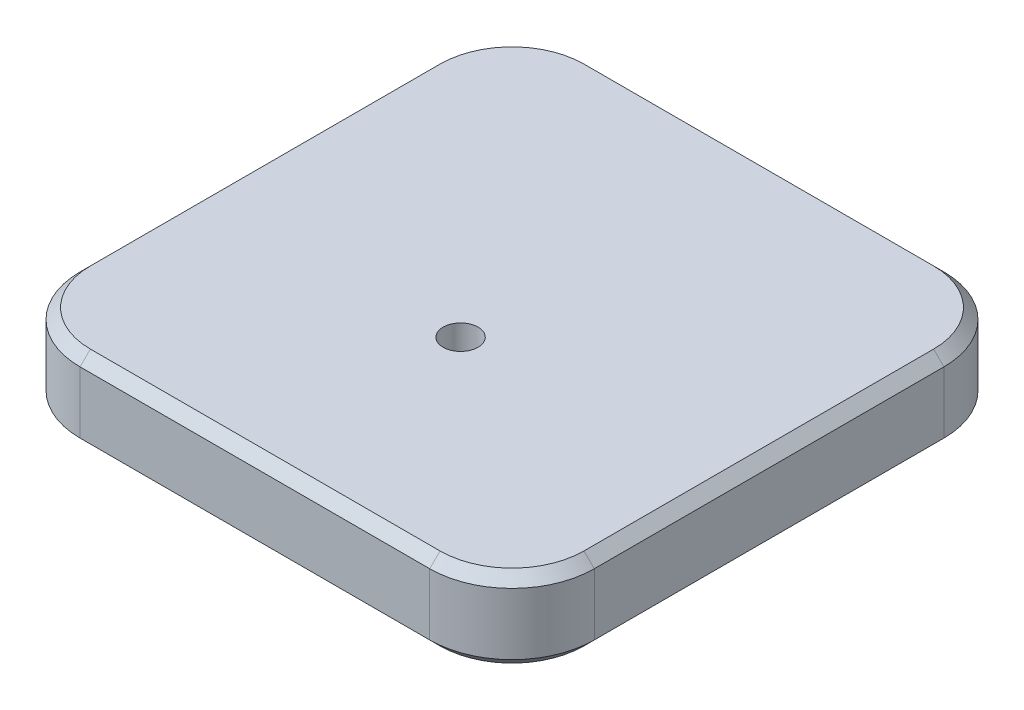
ISO-10303-21;
HEADER;
FILE_DESCRIPTION(('STEP AP214'),'2;1');
FILE_NAME('part.step','',(''),(''),'','','');
FILE_SCHEMA(('AUTOMOTIVE_DESIGN { 1 0 10303 214 1 1 1 1 }'));
ENDSEC;
DATA;
#1=APPLICATION_CONTEXT('core data for automotive mechanical design processes');
#2=APPLICATION_PROTOCOL_DEFINITION('international standard','automotive_design',2000,#1);
#3=PRODUCT_CONTEXT('',#1,'mechanical');
#4=PRODUCT('Part','Part','',(#3));
#5=PRODUCT_RELATED_PRODUCT_CATEGORY('part','',(#4));
#6=PRODUCT_DEFINITION_FORMATION('','',#4);
#7=PRODUCT_DEFINITION_CONTEXT('part definition',#1,'design');
#8=PRODUCT_DEFINITION('design','',#6,#7);
#9=PRODUCT_DEFINITION_SHAPE('','',#8);
#10=(LENGTH_UNIT() NAMED_UNIT(*) SI_UNIT(.MILLI.,.METRE.));
#11=(NAMED_UNIT(*) PLANE_ANGLE_UNIT() SI_UNIT($,.RADIAN.));
#12=(NAMED_UNIT(*) SI_UNIT($,.STERADIAN.) SOLID_ANGLE_UNIT());
#13=UNCERTAINTY_MEASURE_WITH_UNIT(LENGTH_MEASURE(1.E-05),#10,'distance_accuracy_value','');
#14=(GEOMETRIC_REPRESENTATION_CONTEXT(3) GLOBAL_UNCERTAINTY_ASSIGNED_CONTEXT((#13)) GLOBAL_UNIT_ASSIGNED_CONTEXT((#10,
#11,#12)) REPRESENTATION_CONTEXT('',''));
#15=CARTESIAN_POINT('',(0.,0.,0.));
#16=DIRECTION('',(0.,0.,1.));
#17=DIRECTION('',(1.,0.,0.));
#18=AXIS2_PLACEMENT_3D('',#15,#16,#17);
#19=CARTESIAN_POINT('',(-17.6882873331806,4.,-15.9443716806135));
#20=DIRECTION('',(1.,0.,0.));
#21=DIRECTION('',(0.,0.,-1.));
#22=AXIS2_PLACEMENT_3D('',#19,#20,#21);
#23=PLANE('',#22);
#24=DIRECTION('',(0.,-1.,0.));
#25=VECTOR('',#24,1.);
#26=CARTESIAN_POINT('',(-17.6882873331806,4.,-11.9443716806135));
#27=LINE('',#26,#25);
#28=CARTESIAN_POINT('',(-17.6882873331806,3.5,-11.9443716806135));
#29=VERTEX_POINT('',#28);
#30=CARTESIAN_POINT('',(-17.6882873331806,0.499999999999997,-11.9443716806135));
#31=VERTEX_POINT('',#30);
#32=EDGE_CURVE('E284',#29,#31,#27,.T.);
#33=ORIENTED_EDGE('',*,*,#32,.T.);
#34=DIRECTION('',(0.,0.,1.));
#35=VECTOR('',#34,1.);
#36=CARTESIAN_POINT('',(-17.6882873331806,0.499999999999997,-15.9443716806135));
#37=LINE('',#36,#35);
#38=CARTESIAN_POINT('',(-17.6882873331806,0.499999999999997,5.05562831938651));
#39=VERTEX_POINT('',#38);
#40=EDGE_CURVE('E196',#31,#39,#37,.T.);
#41=ORIENTED_EDGE('',*,*,#40,.T.);
#42=DIRECTION('',(0.,-1.,0.));
#43=VECTOR('',#42,1.);
#44=CARTESIAN_POINT('',(-17.6882873331806,4.,5.05562831938651));
#45=LINE('',#44,#43);
#46=CARTESIAN_POINT('',(-17.6882873331806,3.5,5.05562831938651));
#47=VERTEX_POINT('',#46);
#48=EDGE_CURVE('E368',#39,#47,#45,.F.);
#49=ORIENTED_EDGE('',*,*,#48,.T.);
#50=DIRECTION('',(0.,0.,-1.));
#51=VECTOR('',#50,1.);
#52=CARTESIAN_POINT('',(-17.6882873331806,3.5,-11.9443716806135));
#53=LINE('',#52,#51);
#54=EDGE_CURVE('E194',#47,#29,#53,.T.);
#55=ORIENTED_EDGE('',*,*,#54,.T.);
#56=EDGE_LOOP('',(#33,#41,#49,#55));
#57=FACE_BOUND('',#56,.T.);
#58=ADVANCED_FACE('F38',(#57),#23,.F.);
#59=CARTESIAN_POINT('',(-17.6882873331806,4.,9.05562831938651));
#60=DIRECTION('',(0.,0.,-1.));
#61=DIRECTION('',(-1.,0.,0.));
#62=AXIS2_PLACEMENT_3D('',#59,#60,#61);
#63=PLANE('',#62);
#64=DIRECTION('',(0.,-1.,0.));
#65=VECTOR('',#64,1.);
#66=CARTESIAN_POINT('',(-13.6882873331806,4.,9.05562831938651));
#67=LINE('',#66,#65);
#68=CARTESIAN_POINT('',(-13.6882873331806,3.5,9.05562831938651));
#69=VERTEX_POINT('',#68);
#70=CARTESIAN_POINT('',(-13.6882873331806,0.499999999999997,9.05562831938651));
#71=VERTEX_POINT('',#70);
#72=EDGE_CURVE('E301',#69,#71,#67,.T.);
#73=ORIENTED_EDGE('',*,*,#72,.T.);
#74=DIRECTION('',(1.,0.,0.));
#75=VECTOR('',#74,1.);
#76=CARTESIAN_POINT('',(-17.6882873331806,0.499999999999997,9.05562831938651));
#77=LINE('',#76,#75);
#78=CARTESIAN_POINT('',(3.31171266681941,0.499999999999997,9.05562831938651));
#79=VERTEX_POINT('',#78);
#80=EDGE_CURVE('E204',#71,#79,#77,.T.);
#81=ORIENTED_EDGE('',*,*,#80,.T.);
#82=DIRECTION('',(0.,-1.,0.));
#83=VECTOR('',#82,1.);
#84=CARTESIAN_POINT('',(3.31171266681941,4.,9.05562831938651));
#85=LINE('',#84,#83);
#86=CARTESIAN_POINT('',(3.31171266681941,3.5,9.05562831938651));
#87=VERTEX_POINT('',#86);
#88=EDGE_CURVE('E171',#79,#87,#85,.F.);
#89=ORIENTED_EDGE('',*,*,#88,.T.);
#90=DIRECTION('',(-1.,0.,0.));
#91=VECTOR('',#90,1.);
#92=CARTESIAN_POINT('',(-13.6882873331806,3.5,9.05562831938651));
#93=LINE('',#92,#91);
#94=EDGE_CURVE('E202',#87,#69,#93,.T.);
#95=ORIENTED_EDGE('',*,*,#94,.T.);
#96=EDGE_LOOP('',(#73,#81,#89,#95));
#97=FACE_BOUND('',#96,.T.);
#98=ADVANCED_FACE('F347',(#97),#63,.F.);
#99=CARTESIAN_POINT('',(7.3117126668194,4.,-15.9443716806135));
#100=DIRECTION('',(-1.,0.,0.));
#101=DIRECTION('',(0.,0.,1.));
#102=AXIS2_PLACEMENT_3D('',#99,#100,#101);
#103=PLANE('',#102);
#104=DIRECTION('',(0.,-1.,0.));
#105=VECTOR('',#104,1.);
#106=CARTESIAN_POINT('',(7.31171266681941,4.,5.0556283193865));
#107=LINE('',#106,#105);
#108=CARTESIAN_POINT('',(7.31171266681941,3.5,5.0556283193865));
#109=VERTEX_POINT('',#108);
#110=CARTESIAN_POINT('',(7.31171266681941,0.499999999999997,5.0556283193865));
#111=VERTEX_POINT('',#110);
#112=EDGE_CURVE('E290',#109,#111,#107,.T.);
#113=ORIENTED_EDGE('',*,*,#112,.T.);
#114=DIRECTION('',(0.,0.,-1.));
#115=VECTOR('',#114,1.);
#116=CARTESIAN_POINT('',(7.3117126668194,0.499999999999997,-15.9443716806135));
#117=LINE('',#116,#115);
#118=CARTESIAN_POINT('',(7.31171266681941,0.499999999999997,-11.9443716806135));
#119=VERTEX_POINT('',#118);
#120=EDGE_CURVE('E213',#111,#119,#117,.T.);
#121=ORIENTED_EDGE('',*,*,#120,.T.);
#122=DIRECTION('',(0.,-1.,0.));
#123=VECTOR('',#122,1.);
#124=CARTESIAN_POINT('',(7.31171266681941,4.,-11.9443716806135));
#125=LINE('',#124,#123);
#126=CARTESIAN_POINT('',(7.31171266681941,3.5,-11.9443716806135));
#127=VERTEX_POINT('',#126);
#128=EDGE_CURVE('E294',#119,#127,#125,.F.);
#129=ORIENTED_EDGE('',*,*,#128,.T.);
#130=DIRECTION('',(0.,0.,1.));
#131=VECTOR('',#130,1.);
#132=CARTESIAN_POINT('',(7.31171266681941,3.5,5.0556283193865));
#133=LINE('',#132,#131);
#134=EDGE_CURVE('E211',#127,#109,#133,.T.);
#135=ORIENTED_EDGE('',*,*,#134,.T.);
#136=EDGE_LOOP('',(#113,#121,#129,#135));
#137=FACE_BOUND('',#136,.T.);
#138=ADVANCED_FACE('F327',(#137),#103,.F.);
#139=CARTESIAN_POINT('',(-17.6882873331806,4.,-15.9443716806135));
#140=DIRECTION('',(0.,0.,1.));
#141=DIRECTION('',(1.,0.,0.));
#142=AXIS2_PLACEMENT_3D('',#139,#140,#141);
#143=PLANE('',#142);
#144=DIRECTION('',(0.,-1.,0.));
#145=VECTOR('',#144,1.);
#146=CARTESIAN_POINT('',(3.3117126668194,4.,-15.9443716806135));
#147=LINE('',#146,#145);
#148=CARTESIAN_POINT('',(3.3117126668194,3.5,-15.9443716806135));
#149=VERTEX_POINT('',#148);
#150=CARTESIAN_POINT('',(3.3117126668194,0.499999999999997,-15.9443716806135));
#151=VERTEX_POINT('',#150);
#152=EDGE_CURVE('E291',#149,#151,#147,.T.);
#153=ORIENTED_EDGE('',*,*,#152,.T.);
#154=DIRECTION('',(-1.,0.,0.));
#155=VECTOR('',#154,1.);
#156=CARTESIAN_POINT('',(-17.6882873331806,0.499999999999997,-15.9443716806135));
#157=LINE('',#156,#155);
#158=CARTESIAN_POINT('',(-13.6882873331806,0.499999999999997,-15.9443716806135));
#159=VERTEX_POINT('',#158);
#160=EDGE_CURVE('E188',#151,#159,#157,.T.);
#161=ORIENTED_EDGE('',*,*,#160,.T.);
#162=DIRECTION('',(0.,-1.,0.));
#163=VECTOR('',#162,1.);
#164=CARTESIAN_POINT('',(-13.6882873331806,4.,-15.9443716806135));
#165=LINE('',#164,#163);
#166=CARTESIAN_POINT('',(-13.6882873331806,3.5,-15.9443716806135));
#167=VERTEX_POINT('',#166);
#168=EDGE_CURVE('E281',#159,#167,#165,.F.);
#169=ORIENTED_EDGE('',*,*,#168,.T.);
#170=DIRECTION('',(1.,0.,0.));
#171=VECTOR('',#170,1.);
#172=CARTESIAN_POINT('',(3.3117126668194,3.5,-15.9443716806135));
#173=LINE('',#172,#171);
#174=EDGE_CURVE('E186',#167,#149,#173,.T.);
#175=ORIENTED_EDGE('',*,*,#174,.T.);
#176=EDGE_LOOP('',(#153,#161,#169,#175));
#177=FACE_BOUND('',#176,.T.);
#178=ADVANCED_FACE('F287',(#177),#143,.F.);
#179=CARTESIAN_POINT('',(0.,4.,0.));
#180=DIRECTION('',(0.,1.,0.));
#181=DIRECTION('',(0.,0.,1.));
#182=AXIS2_PLACEMENT_3D('',#179,#180,#181);
#183=PLANE('',#182);
#184=DIRECTION('',(1.,0.,0.));
#185=VECTOR('',#184,1.);
#186=CARTESIAN_POINT('',(3.31171266681941,4.,8.55562831938651));
#187=LINE('',#186,#185);
#188=CARTESIAN_POINT('',(-13.6882873331806,4.,8.55562831938651));
#189=VERTEX_POINT('',#188);
#190=CARTESIAN_POINT('',(3.31171266681941,4.,8.55562831938651));
#191=VERTEX_POINT('',#190);
#192=EDGE_CURVE('E47',#189,#191,#187,.T.);
#193=ORIENTED_EDGE('',*,*,#192,.T.);
#194=CARTESIAN_POINT('',(3.31171266681941,4.,5.05562831938651));
#195=DIRECTION('',(0.,1.,0.));
#196=DIRECTION('',(0.,0.,1.));
#197=AXIS2_PLACEMENT_3D('',#194,#195,#196);
#198=CIRCLE('',#197,3.5);
#199=CARTESIAN_POINT('',(6.81171266681941,4.,5.0556283193865));
#200=VERTEX_POINT('',#199);
#201=EDGE_CURVE('E11',#191,#200,#198,.T.);
#202=ORIENTED_EDGE('',*,*,#201,.T.);
#203=DIRECTION('',(0.,0.,-1.));
#204=VECTOR('',#203,1.);
#205=CARTESIAN_POINT('',(6.8117126668194,4.,-11.9443716806135));
#206=LINE('',#205,#204);
#207=CARTESIAN_POINT('',(6.8117126668194,4.,-11.9443716806135));
#208=VERTEX_POINT('',#207);
#209=EDGE_CURVE('E215',#200,#208,#206,.T.);
#210=ORIENTED_EDGE('',*,*,#209,.T.);
#211=CARTESIAN_POINT('',(3.3117126668194,4.,-11.9443716806135));
#212=DIRECTION('',(0.,1.,0.));
#213=DIRECTION('',(0.,0.,1.));
#214=AXIS2_PLACEMENT_3D('',#211,#212,#213);
#215=CIRCLE('',#214,3.5);
#216=CARTESIAN_POINT('',(3.3117126668194,4.,-15.4443716806135));
#217=VERTEX_POINT('',#216);
#218=EDGE_CURVE('E217',#208,#217,#215,.T.);
#219=ORIENTED_EDGE('',*,*,#218,.T.);
#220=DIRECTION('',(-1.,0.,0.));
#221=VECTOR('',#220,1.);
#222=CARTESIAN_POINT('',(-13.6882873331806,4.,-15.4443716806135));
#223=LINE('',#222,#221);
#224=CARTESIAN_POINT('',(-13.6882873331806,4.,-15.4443716806135));
#225=VERTEX_POINT('',#224);
#226=EDGE_CURVE('E219',#217,#225,#223,.T.);
#227=ORIENTED_EDGE('',*,*,#226,.T.);
#228=CARTESIAN_POINT('',(-13.6882873331806,4.,-11.9443716806135));
#229=DIRECTION('',(0.,1.,0.));
#230=DIRECTION('',(0.,0.,1.));
#231=AXIS2_PLACEMENT_3D('',#228,#229,#230);
#232=CIRCLE('',#231,3.5);
#233=CARTESIAN_POINT('',(-17.1882873331806,4.,-11.9443716806135));
#234=VERTEX_POINT('',#233);
#235=EDGE_CURVE('E221',#225,#234,#232,.T.);
#236=ORIENTED_EDGE('',*,*,#235,.T.);
#237=DIRECTION('',(0.,0.,1.));
#238=VECTOR('',#237,1.);
#239=CARTESIAN_POINT('',(-17.1882873331806,4.,5.05562831938651));
#240=LINE('',#239,#238);
#241=CARTESIAN_POINT('',(-17.1882873331806,4.,5.05562831938651));
#242=VERTEX_POINT('',#241);
#243=EDGE_CURVE('E223',#234,#242,#240,.T.);
#244=ORIENTED_EDGE('',*,*,#243,.T.);
#245=CARTESIAN_POINT('',(-13.6882873331806,4.,5.05562831938651));
#246=DIRECTION('',(0.,1.,0.));
#247=DIRECTION('',(0.,0.,1.));
#248=AXIS2_PLACEMENT_3D('',#245,#246,#247);
#249=CIRCLE('',#248,3.5);
#250=EDGE_CURVE('E58',#242,#189,#249,.T.);
#251=ORIENTED_EDGE('',*,*,#250,.T.);
#252=EDGE_LOOP('',(#193,#202,#210,#219,#227,#236,#244,#251));
#253=FACE_BOUND('',#252,.T.);
#254=CARTESIAN_POINT('',(-5.18828733318059,4.,-0.944371680613496));
#255=DIRECTION('',(0.,1.,0.));
#256=DIRECTION('',(0.,0.,1.));
#257=AXIS2_PLACEMENT_3D('',#254,#255,#256);
#258=CIRCLE('',#257,0.849999999999999);
#259=CARTESIAN_POINT('',(-5.18828733318059,4.,-0.0943716806134968));
#260=VERTEX_POINT('',#259);
#261=EDGE_CURVE('E244',#260,#260,#258,.T.);
#262=ORIENTED_EDGE('',*,*,#261,.F.);
#263=EDGE_LOOP('',(#262));
#264=FACE_BOUND('',#263,.T.);
#265=ADVANCED_FACE('F383',(#253,#264),#183,.T.);
#266=CARTESIAN_POINT('',(0.,0.,0.));
#267=DIRECTION('',(0.,1.,0.));
#268=DIRECTION('',(0.,0.,1.));
#269=AXIS2_PLACEMENT_3D('',#266,#267,#268);
#270=PLANE('',#269);
#271=DIRECTION('',(1.,0.,0.));
#272=VECTOR('',#271,1.);
#273=CARTESIAN_POINT('',(0.,0.,-15.4443716806135));
#274=LINE('',#273,#272);
#275=CARTESIAN_POINT('',(-13.6882873331806,0.,-15.4443716806135));
#276=VERTEX_POINT('',#275);
#277=CARTESIAN_POINT('',(3.3117126668194,0.,-15.4443716806135));
#278=VERTEX_POINT('',#277);
#279=EDGE_CURVE('E176',#276,#278,#274,.T.);
#280=ORIENTED_EDGE('',*,*,#279,.T.);
#281=CARTESIAN_POINT('',(3.3117126668194,0.,-11.9443716806135));
#282=DIRECTION('',(0.,1.,0.));
#283=DIRECTION('',(0.,0.,1.));
#284=AXIS2_PLACEMENT_3D('',#281,#282,#283);
#285=CIRCLE('',#284,3.5);
#286=CARTESIAN_POINT('',(6.8117126668194,0.,-11.9443716806135));
#287=VERTEX_POINT('',#286);
#288=EDGE_CURVE('E156',#278,#287,#285,.F.);
#289=ORIENTED_EDGE('',*,*,#288,.T.);
#290=DIRECTION('',(0.,0.,1.));
#291=VECTOR('',#290,1.);
#292=CARTESIAN_POINT('',(6.81171266681941,0.,0.));
#293=LINE('',#292,#291);
#294=CARTESIAN_POINT('',(6.81171266681941,0.,5.0556283193865));
#295=VERTEX_POINT('',#294);
#296=EDGE_CURVE('E164',#287,#295,#293,.T.);
#297=ORIENTED_EDGE('',*,*,#296,.T.);
#298=CARTESIAN_POINT('',(3.31171266681941,0.,5.05562831938651));
#299=DIRECTION('',(0.,1.,0.));
#300=DIRECTION('',(0.,0.,1.));
#301=AXIS2_PLACEMENT_3D('',#298,#299,#300);
#302=CIRCLE('',#301,3.5);
#303=CARTESIAN_POINT('',(3.31171266681941,0.,8.55562831938651));
#304=VERTEX_POINT('',#303);
#305=EDGE_CURVE('E170',#295,#304,#302,.F.);
#306=ORIENTED_EDGE('',*,*,#305,.T.);
#307=DIRECTION('',(-1.,0.,0.));
#308=VECTOR('',#307,1.);
#309=CARTESIAN_POINT('',(0.,0.,8.55562831938651));
#310=LINE('',#309,#308);
#311=CARTESIAN_POINT('',(-13.6882873331806,0.,8.55562831938651));
#312=VERTEX_POINT('',#311);
#313=EDGE_CURVE('E307',#304,#312,#310,.T.);
#314=ORIENTED_EDGE('',*,*,#313,.T.);
#315=CARTESIAN_POINT('',(-13.6882873331806,0.,5.05562831938651));
#316=DIRECTION('',(0.,1.,0.));
#317=DIRECTION('',(0.,0.,1.));
#318=AXIS2_PLACEMENT_3D('',#315,#316,#317);
#319=CIRCLE('',#318,3.5);
#320=CARTESIAN_POINT('',(-17.1882873331806,0.,5.05562831938651));
#321=VERTEX_POINT('',#320);
#322=EDGE_CURVE('E309',#312,#321,#319,.F.);
#323=ORIENTED_EDGE('',*,*,#322,.T.);
#324=DIRECTION('',(0.,0.,-1.));
#325=VECTOR('',#324,1.);
#326=CARTESIAN_POINT('',(-17.1882873331806,0.,0.));
#327=LINE('',#326,#325);
#328=CARTESIAN_POINT('',(-17.1882873331806,0.,-11.9443716806135));
#329=VERTEX_POINT('',#328);
#330=EDGE_CURVE('E311',#321,#329,#327,.T.);
#331=ORIENTED_EDGE('',*,*,#330,.T.);
#332=CARTESIAN_POINT('',(-13.6882873331806,0.,-11.9443716806135));
#333=DIRECTION('',(0.,1.,0.));
#334=DIRECTION('',(0.,0.,1.));
#335=AXIS2_PLACEMENT_3D('',#332,#333,#334);
#336=CIRCLE('',#335,3.5);
#337=EDGE_CURVE('E181',#329,#276,#336,.F.);
#338=ORIENTED_EDGE('',*,*,#337,.T.);
#339=EDGE_LOOP('',(#280,#289,#297,#306,#314,#323,#331,#338));
#340=FACE_BOUND('',#339,.T.);
#341=CARTESIAN_POINT('',(-5.18828733318059,0.,-0.944371680613496));
#342=DIRECTION('',(0.,1.,0.));
#343=DIRECTION('',(0.,0.,1.));
#344=AXIS2_PLACEMENT_3D('',#341,#342,#343);
#345=CIRCLE('',#344,0.849999999999998);
#346=CARTESIAN_POINT('',(-5.18828733318059,0.,-0.0943716806134976));
#347=VERTEX_POINT('',#346);
#348=EDGE_CURVE('E372',#347,#347,#345,.T.);
#349=ORIENTED_EDGE('',*,*,#348,.T.);
#350=EDGE_LOOP('',(#349));
#351=FACE_BOUND('',#350,.T.);
#352=ADVANCED_FACE('F173',(#340,#351),#270,.F.);
#353=CARTESIAN_POINT('',(-13.6882873331806,4.,-11.9443716806135));
#354=DIRECTION('',(0.,-1.,0.));
#355=DIRECTION('',(0.,0.,-1.));
#356=AXIS2_PLACEMENT_3D('',#353,#354,#355);
#357=CYLINDRICAL_SURFACE('',#356,4.);
#358=ORIENTED_EDGE('',*,*,#168,.F.);
#359=CARTESIAN_POINT('',(-13.6882873331806,0.499999999999997,-11.9443716806135));
#360=DIRECTION('',(0.,1.,0.));
#361=DIRECTION('',(0.,0.,1.));
#362=AXIS2_PLACEMENT_3D('',#359,#360,#361);
#363=CIRCLE('',#362,4.);
#364=EDGE_CURVE('E192',#159,#31,#363,.T.);
#365=ORIENTED_EDGE('',*,*,#364,.T.);
#366=ORIENTED_EDGE('',*,*,#32,.F.);
#367=CARTESIAN_POINT('',(-13.6882873331806,3.5,-11.9443716806135));
#368=DIRECTION('',(0.,1.,0.));
#369=DIRECTION('',(0.,0.,1.));
#370=AXIS2_PLACEMENT_3D('',#367,#368,#369);
#371=CIRCLE('',#370,4.);
#372=EDGE_CURVE('E190',#29,#167,#371,.F.);
#373=ORIENTED_EDGE('',*,*,#372,.T.);
#374=EDGE_LOOP('',(#358,#365,#366,#373));
#375=FACE_BOUND('',#374,.T.);
#376=ADVANCED_FACE('F280',(#375),#357,.T.);
#377=CARTESIAN_POINT('',(3.3117126668194,4.,-11.9443716806135));
#378=DIRECTION('',(0.,-1.,0.));
#379=DIRECTION('',(0.,0.,-1.));
#380=AXIS2_PLACEMENT_3D('',#377,#378,#379);
#381=CYLINDRICAL_SURFACE('',#380,4.);
#382=ORIENTED_EDGE('',*,*,#128,.F.);
#383=CARTESIAN_POINT('',(3.3117126668194,0.499999999999997,-11.9443716806135));
#384=DIRECTION('',(0.,1.,0.));
#385=DIRECTION('',(0.,0.,1.));
#386=AXIS2_PLACEMENT_3D('',#383,#384,#385);
#387=CIRCLE('',#386,4.);
#388=EDGE_CURVE('E158',#119,#151,#387,.T.);
#389=ORIENTED_EDGE('',*,*,#388,.T.);
#390=ORIENTED_EDGE('',*,*,#152,.F.);
#391=CARTESIAN_POINT('',(3.3117126668194,3.5,-11.9443716806135));
#392=DIRECTION('',(0.,1.,0.));
#393=DIRECTION('',(0.,0.,1.));
#394=AXIS2_PLACEMENT_3D('',#391,#392,#393);
#395=CIRCLE('',#394,4.);
#396=EDGE_CURVE('E178',#149,#127,#395,.F.);
#397=ORIENTED_EDGE('',*,*,#396,.T.);
#398=EDGE_LOOP('',(#382,#389,#390,#397));
#399=FACE_BOUND('',#398,.T.);
#400=ADVANCED_FACE('F322',(#399),#381,.T.);
#401=CARTESIAN_POINT('',(3.31171266681941,4.,5.05562831938651));
#402=DIRECTION('',(0.,-1.,0.));
#403=DIRECTION('',(0.,0.,-1.));
#404=AXIS2_PLACEMENT_3D('',#401,#402,#403);
#405=CYLINDRICAL_SURFACE('',#404,4.);
#406=ORIENTED_EDGE('',*,*,#88,.F.);
#407=CARTESIAN_POINT('',(3.31171266681941,0.499999999999997,5.05562831938651));
#408=DIRECTION('',(0.,1.,0.));
#409=DIRECTION('',(0.,0.,1.));
#410=AXIS2_PLACEMENT_3D('',#407,#408,#409);
#411=CIRCLE('',#410,4.);
#412=EDGE_CURVE('E209',#79,#111,#411,.T.);
#413=ORIENTED_EDGE('',*,*,#412,.T.);
#414=ORIENTED_EDGE('',*,*,#112,.F.);
#415=CARTESIAN_POINT('',(3.31171266681941,3.5,5.05562831938651));
#416=DIRECTION('',(0.,1.,0.));
#417=DIRECTION('',(0.,0.,1.));
#418=AXIS2_PLACEMENT_3D('',#415,#416,#417);
#419=CIRCLE('',#418,4.);
#420=EDGE_CURVE('E206',#109,#87,#419,.F.);
#421=ORIENTED_EDGE('',*,*,#420,.T.);
#422=EDGE_LOOP('',(#406,#413,#414,#421));
#423=FACE_BOUND('',#422,.T.);
#424=ADVANCED_FACE('F344',(#423),#405,.T.);
#425=CARTESIAN_POINT('',(-13.6882873331806,4.,5.05562831938651));
#426=DIRECTION('',(0.,-1.,0.));
#427=DIRECTION('',(0.,0.,-1.));
#428=AXIS2_PLACEMENT_3D('',#425,#426,#427);
#429=CYLINDRICAL_SURFACE('',#428,4.);
#430=ORIENTED_EDGE('',*,*,#48,.F.);
#431=CARTESIAN_POINT('',(-13.6882873331806,0.499999999999997,5.05562831938651));
#432=DIRECTION('',(0.,1.,0.));
#433=DIRECTION('',(0.,0.,1.));
#434=AXIS2_PLACEMENT_3D('',#431,#432,#433);
#435=CIRCLE('',#434,4.);
#436=EDGE_CURVE('E200',#39,#71,#435,.T.);
#437=ORIENTED_EDGE('',*,*,#436,.T.);
#438=ORIENTED_EDGE('',*,*,#72,.F.);
#439=CARTESIAN_POINT('',(-13.6882873331806,3.5,5.05562831938651));
#440=DIRECTION('',(0.,1.,0.));
#441=DIRECTION('',(0.,0.,1.));
#442=AXIS2_PLACEMENT_3D('',#439,#440,#441);
#443=CIRCLE('',#442,4.);
#444=EDGE_CURVE('E198',#69,#47,#443,.F.);
#445=ORIENTED_EDGE('',*,*,#444,.T.);
#446=EDGE_LOOP('',(#430,#437,#438,#445));
#447=FACE_BOUND('',#446,.T.);
#448=ADVANCED_FACE('F370',(#447),#429,.T.);
#449=CARTESIAN_POINT('',(-5.18828733318059,4.,-0.944371680613496));
#450=DIRECTION('',(0.,1.,0.));
#451=DIRECTION('',(0.,0.,1.));
#452=AXIS2_PLACEMENT_3D('',#449,#450,#451);
#453=CYLINDRICAL_SURFACE('',#452,0.849999999999998);
#454=ORIENTED_EDGE('',*,*,#261,.T.);
#455=EDGE_LOOP('',(#454));
#456=FACE_BOUND('',#455,.T.);
#457=ORIENTED_EDGE('',*,*,#348,.F.);
#458=EDGE_LOOP('',(#457));
#459=FACE_BOUND('',#458,.T.);
#460=ADVANCED_FACE('F380',(#456,#459),#453,.F.);
#461=CARTESIAN_POINT('',(-13.6882873331806,0.,5.05562831938651));
#462=DIRECTION('',(0.,1.,0.));
#463=DIRECTION('',(0.,0.,1.));
#464=AXIS2_PLACEMENT_3D('',#461,#462,#463);
#465=CONICAL_SURFACE('',#464,3.5,0.785398163397452);
#466=DIRECTION('',(0.,-0.707106781186545,-0.70710678118655));
#467=VECTOR('',#466,1.);
#468=CARTESIAN_POINT('',(-13.6882873331806,0.499999999999997,9.05562831938651));
#469=LINE('',#468,#467);
#470=EDGE_CURVE('E238',#71,#312,#469,.T.);
#471=ORIENTED_EDGE('',*,*,#470,.F.);
#472=ORIENTED_EDGE('',*,*,#436,.F.);
#473=DIRECTION('',(-0.70710678118655,0.707106781186545,0.));
#474=VECTOR('',#473,1.);
#475=CARTESIAN_POINT('',(-17.1882873331806,0.,5.05562831938651));
#476=LINE('',#475,#474);
#477=EDGE_CURVE('E241',#321,#39,#476,.T.);
#478=ORIENTED_EDGE('',*,*,#477,.F.);
#479=ORIENTED_EDGE('',*,*,#322,.F.);
#480=EDGE_LOOP('',(#471,#472,#478,#479));
#481=FACE_BOUND('',#480,.T.);
#482=ADVANCED_FACE('F360',(#481),#465,.T.);
#483=CARTESIAN_POINT('',(-17.6882873331806,0.499999999999997,-15.9443716806135));
#484=DIRECTION('',(0.707106781186546,0.707106781186549,0.));
#485=DIRECTION('',(0.,0.,1.));
#486=AXIS2_PLACEMENT_3D('',#483,#484,#485);
#487=PLANE('',#486);
#488=ORIENTED_EDGE('',*,*,#477,.T.);
#489=ORIENTED_EDGE('',*,*,#40,.F.);
#490=DIRECTION('',(-0.70710678118655,0.707106781186545,0.));
#491=VECTOR('',#490,1.);
#492=CARTESIAN_POINT('',(-17.1882873331806,0.,-11.9443716806135));
#493=LINE('',#492,#491);
#494=EDGE_CURVE('E235',#329,#31,#493,.T.);
#495=ORIENTED_EDGE('',*,*,#494,.F.);
#496=ORIENTED_EDGE('',*,*,#330,.F.);
#497=EDGE_LOOP('',(#488,#489,#495,#496));
#498=FACE_BOUND('',#497,.T.);
#499=ADVANCED_FACE('F364',(#498),#487,.F.);
#500=CARTESIAN_POINT('',(-17.6882873331806,0.499999999999997,9.05562831938651));
#501=DIRECTION('',(0.,0.70710678118655,-0.707106781186545));
#502=DIRECTION('',(1.,0.,0.));
#503=AXIS2_PLACEMENT_3D('',#500,#501,#502);
#504=PLANE('',#503);
#505=ORIENTED_EDGE('',*,*,#470,.T.);
#506=ORIENTED_EDGE('',*,*,#313,.F.);
#507=DIRECTION('',(0.,-0.707106781186545,-0.70710678118655));
#508=VECTOR('',#507,1.);
#509=CARTESIAN_POINT('',(3.31171266681941,0.499999999999997,9.05562831938651));
#510=LINE('',#509,#508);
#511=EDGE_CURVE('E232',#79,#304,#510,.T.);
#512=ORIENTED_EDGE('',*,*,#511,.F.);
#513=ORIENTED_EDGE('',*,*,#80,.F.);
#514=EDGE_LOOP('',(#505,#506,#512,#513));
#515=FACE_BOUND('',#514,.T.);
#516=ADVANCED_FACE('F352',(#515),#504,.F.);
#517=CARTESIAN_POINT('',(-13.6882873331806,0.,-11.9443716806135));
#518=DIRECTION('',(0.,1.,0.));
#519=DIRECTION('',(0.,0.,1.));
#520=AXIS2_PLACEMENT_3D('',#517,#518,#519);
#521=CONICAL_SURFACE('',#520,3.5,0.785398163397452);
#522=ORIENTED_EDGE('',*,*,#494,.T.);
#523=ORIENTED_EDGE('',*,*,#364,.F.);
#524=DIRECTION('',(0.,0.707106781186545,-0.70710678118655));
#525=VECTOR('',#524,1.);
#526=CARTESIAN_POINT('',(-13.6882873331806,0.,-15.4443716806135));
#527=LINE('',#526,#525);
#528=EDGE_CURVE('E229',#276,#159,#527,.T.);
#529=ORIENTED_EDGE('',*,*,#528,.F.);
#530=ORIENTED_EDGE('',*,*,#337,.F.);
#531=EDGE_LOOP('',(#522,#523,#529,#530));
#532=FACE_BOUND('',#531,.T.);
#533=ADVANCED_FACE('F317',(#532),#521,.T.);
#534=CARTESIAN_POINT('',(3.31171266681941,0.,5.05562831938651));
#535=DIRECTION('',(0.,1.,0.));
#536=DIRECTION('',(0.,0.,1.));
#537=AXIS2_PLACEMENT_3D('',#534,#535,#536);
#538=CONICAL_SURFACE('',#537,3.5,0.785398163397452);
#539=ORIENTED_EDGE('',*,*,#511,.T.);
#540=ORIENTED_EDGE('',*,*,#305,.F.);
#541=DIRECTION('',(-0.70710678118655,-0.707106781186545,0.));
#542=VECTOR('',#541,1.);
#543=CARTESIAN_POINT('',(7.31171266681941,0.499999999999997,5.0556283193865));
#544=LINE('',#543,#542);
#545=EDGE_CURVE('E167',#111,#295,#544,.T.);
#546=ORIENTED_EDGE('',*,*,#545,.F.);
#547=ORIENTED_EDGE('',*,*,#412,.F.);
#548=EDGE_LOOP('',(#539,#540,#546,#547));
#549=FACE_BOUND('',#548,.T.);
#550=ADVANCED_FACE('F356',(#549),#538,.T.);
#551=CARTESIAN_POINT('',(-17.6882873331806,0.499999999999997,-15.9443716806135));
#552=DIRECTION('',(0.,0.70710678118655,0.707106781186545));
#553=DIRECTION('',(-1.,0.,0.));
#554=AXIS2_PLACEMENT_3D('',#551,#552,#553);
#555=PLANE('',#554);
#556=ORIENTED_EDGE('',*,*,#528,.T.);
#557=ORIENTED_EDGE('',*,*,#160,.F.);
#558=DIRECTION('',(0.,0.707106781186545,-0.70710678118655));
#559=VECTOR('',#558,1.);
#560=CARTESIAN_POINT('',(3.3117126668194,0.,-15.4443716806135));
#561=LINE('',#560,#559);
#562=EDGE_CURVE('E161',#278,#151,#561,.T.);
#563=ORIENTED_EDGE('',*,*,#562,.F.);
#564=ORIENTED_EDGE('',*,*,#279,.F.);
#565=EDGE_LOOP('',(#556,#557,#563,#564));
#566=FACE_BOUND('',#565,.T.);
#567=ADVANCED_FACE('F319',(#566),#555,.F.);
#568=CARTESIAN_POINT('',(7.3117126668194,0.499999999999997,-15.9443716806135));
#569=DIRECTION('',(-0.707106781186545,0.70710678118655,0.));
#570=DIRECTION('',(0.,0.,-1.));
#571=AXIS2_PLACEMENT_3D('',#568,#569,#570);
#572=PLANE('',#571);
#573=ORIENTED_EDGE('',*,*,#545,.T.);
#574=ORIENTED_EDGE('',*,*,#296,.F.);
#575=DIRECTION('',(-0.70710678118655,-0.707106781186545,0.));
#576=VECTOR('',#575,1.);
#577=CARTESIAN_POINT('',(7.31171266681941,0.499999999999997,-11.9443716806135));
#578=LINE('',#577,#576);
#579=EDGE_CURVE('E152',#119,#287,#578,.T.);
#580=ORIENTED_EDGE('',*,*,#579,.F.);
#581=ORIENTED_EDGE('',*,*,#120,.F.);
#582=EDGE_LOOP('',(#573,#574,#580,#581));
#583=FACE_BOUND('',#582,.T.);
#584=ADVANCED_FACE('F165',(#583),#572,.F.);
#585=CARTESIAN_POINT('',(3.3117126668194,0.,-11.9443716806135));
#586=DIRECTION('',(0.,1.,0.));
#587=DIRECTION('',(0.,0.,1.));
#588=AXIS2_PLACEMENT_3D('',#585,#586,#587);
#589=CONICAL_SURFACE('',#588,3.5,0.785398163397452);
#590=ORIENTED_EDGE('',*,*,#562,.T.);
#591=ORIENTED_EDGE('',*,*,#388,.F.);
#592=ORIENTED_EDGE('',*,*,#579,.T.);
#593=ORIENTED_EDGE('',*,*,#288,.F.);
#594=EDGE_LOOP('',(#590,#591,#592,#593));
#595=FACE_BOUND('',#594,.T.);
#596=ADVANCED_FACE('F154',(#595),#589,.T.);
#597=CARTESIAN_POINT('',(-13.6882873331806,4.,-11.9443716806135));
#598=DIRECTION('',(0.,-1.,0.));
#599=DIRECTION('',(0.,0.,-1.));
#600=AXIS2_PLACEMENT_3D('',#597,#598,#599);
#601=CONICAL_SURFACE('',#600,3.5,0.785398163397448);
#602=DIRECTION('',(0.,0.707106781186546,0.707106781186549));
#603=VECTOR('',#602,1.);
#604=CARTESIAN_POINT('',(-13.6882873331806,3.5,-15.9443716806135));
#605=LINE('',#604,#603);
#606=EDGE_CURVE('E260',#167,#225,#605,.T.);
#607=ORIENTED_EDGE('',*,*,#606,.F.);
#608=ORIENTED_EDGE('',*,*,#372,.F.);
#609=DIRECTION('',(-0.70710678118655,-0.707106781186545,0.));
#610=VECTOR('',#609,1.);
#611=CARTESIAN_POINT('',(-17.1882873331806,4.,-11.9443716806135));
#612=LINE('',#611,#610);
#613=EDGE_CURVE('E42',#234,#29,#612,.T.);
#614=ORIENTED_EDGE('',*,*,#613,.F.);
#615=ORIENTED_EDGE('',*,*,#235,.F.);
#616=EDGE_LOOP('',(#607,#608,#614,#615));
#617=FACE_BOUND('',#616,.T.);
#618=ADVANCED_FACE('F40',(#617),#601,.T.);
#619=CARTESIAN_POINT('',(-17.1882873331806,4.,0.));
#620=DIRECTION('',(-0.707106781186548,0.707106781186547,0.));
#621=DIRECTION('',(0.,0.,-1.));
#622=AXIS2_PLACEMENT_3D('',#619,#620,#621);
#623=PLANE('',#622);
#624=ORIENTED_EDGE('',*,*,#613,.T.);
#625=ORIENTED_EDGE('',*,*,#54,.F.);
#626=DIRECTION('',(-0.707106781186545,-0.70710678118655,0.));
#627=VECTOR('',#626,1.);
#628=CARTESIAN_POINT('',(-17.1882873331806,4.,5.05562831938651));
#629=LINE('',#628,#627);
#630=EDGE_CURVE('E258',#242,#47,#629,.T.);
#631=ORIENTED_EDGE('',*,*,#630,.F.);
#632=ORIENTED_EDGE('',*,*,#243,.F.);
#633=EDGE_LOOP('',(#624,#625,#631,#632));
#634=FACE_BOUND('',#633,.T.);
#635=ADVANCED_FACE('F271',(#634),#623,.T.);
#636=CARTESIAN_POINT('',(0.,4.,-15.4443716806135));
#637=DIRECTION('',(0.,0.707106781186547,-0.707106781186547));
#638=DIRECTION('',(1.,0.,0.));
#639=AXIS2_PLACEMENT_3D('',#636,#637,#638);
#640=PLANE('',#639);
#641=ORIENTED_EDGE('',*,*,#606,.T.);
#642=ORIENTED_EDGE('',*,*,#226,.F.);
#643=DIRECTION('',(0.,0.707106781186547,0.707106781186547));
#644=VECTOR('',#643,1.);
#645=CARTESIAN_POINT('',(3.3117126668194,3.5,-15.9443716806135));
#646=LINE('',#645,#644);
#647=EDGE_CURVE('E255',#149,#217,#646,.T.);
#648=ORIENTED_EDGE('',*,*,#647,.F.);
#649=ORIENTED_EDGE('',*,*,#174,.F.);
#650=EDGE_LOOP('',(#641,#642,#648,#649));
#651=FACE_BOUND('',#650,.T.);
#652=ADVANCED_FACE('F438',(#651),#640,.T.);
#653=CARTESIAN_POINT('',(-13.6882873331806,4.,5.05562831938651));
#654=DIRECTION('',(0.,-1.,0.));
#655=DIRECTION('',(0.,0.,-1.));
#656=AXIS2_PLACEMENT_3D('',#653,#654,#655);
#657=CONICAL_SURFACE('',#656,3.5,0.785398163397448);
#658=ORIENTED_EDGE('',*,*,#630,.T.);
#659=ORIENTED_EDGE('',*,*,#444,.F.);
#660=DIRECTION('',(0.,-0.707106781186547,0.707106781186547));
#661=VECTOR('',#660,1.);
#662=CARTESIAN_POINT('',(-13.6882873331806,4.,8.55562831938651));
#663=LINE('',#662,#661);
#664=EDGE_CURVE('E252',#189,#69,#663,.T.);
#665=ORIENTED_EDGE('',*,*,#664,.F.);
#666=ORIENTED_EDGE('',*,*,#250,.F.);
#667=EDGE_LOOP('',(#658,#659,#665,#666));
#668=FACE_BOUND('',#667,.T.);
#669=ADVANCED_FACE('F435',(#668),#657,.T.);
#670=CARTESIAN_POINT('',(3.3117126668194,4.,-11.9443716806135));
#671=DIRECTION('',(0.,-1.,0.));
#672=DIRECTION('',(0.,0.,-1.));
#673=AXIS2_PLACEMENT_3D('',#670,#671,#672);
#674=CONICAL_SURFACE('',#673,3.5,0.785398163397448);
#675=ORIENTED_EDGE('',*,*,#647,.T.);
#676=ORIENTED_EDGE('',*,*,#218,.F.);
#677=DIRECTION('',(-0.707106781186547,0.707106781186547,0.));
#678=VECTOR('',#677,1.);
#679=CARTESIAN_POINT('',(7.3117126668194,3.5,-11.9443716806135));
#680=LINE('',#679,#678);
#681=EDGE_CURVE('E249',#127,#208,#680,.T.);
#682=ORIENTED_EDGE('',*,*,#681,.F.);
#683=ORIENTED_EDGE('',*,*,#396,.F.);
#684=EDGE_LOOP('',(#675,#676,#682,#683));
#685=FACE_BOUND('',#684,.T.);
#686=ADVANCED_FACE('F332',(#685),#674,.T.);
#687=CARTESIAN_POINT('',(0.,4.,8.55562831938651));
#688=DIRECTION('',(0.,0.707106781186547,0.707106781186547));
#689=DIRECTION('',(-1.,0.,0.));
#690=AXIS2_PLACEMENT_3D('',#687,#688,#689);
#691=PLANE('',#690);
#692=ORIENTED_EDGE('',*,*,#664,.T.);
#693=ORIENTED_EDGE('',*,*,#94,.F.);
#694=DIRECTION('',(0.,-0.707106781186547,0.707106781186547));
#695=VECTOR('',#694,1.);
#696=CARTESIAN_POINT('',(3.31171266681941,4.,8.55562831938651));
#697=LINE('',#696,#695);
#698=EDGE_CURVE('E247',#191,#87,#697,.T.);
#699=ORIENTED_EDGE('',*,*,#698,.F.);
#700=ORIENTED_EDGE('',*,*,#192,.F.);
#701=EDGE_LOOP('',(#692,#693,#699,#700));
#702=FACE_BOUND('',#701,.T.);
#703=ADVANCED_FACE('F429',(#702),#691,.T.);
#704=CARTESIAN_POINT('',(6.81171266681941,4.,0.));
#705=DIRECTION('',(0.707106781186548,0.707106781186547,0.));
#706=DIRECTION('',(0.,0.,1.));
#707=AXIS2_PLACEMENT_3D('',#704,#705,#706);
#708=PLANE('',#707);
#709=ORIENTED_EDGE('',*,*,#681,.T.);
#710=ORIENTED_EDGE('',*,*,#209,.F.);
#711=DIRECTION('',(-0.707106781186547,0.707106781186547,0.));
#712=VECTOR('',#711,1.);
#713=CARTESIAN_POINT('',(7.31171266681941,3.5,5.0556283193865));
#714=LINE('',#713,#712);
#715=EDGE_CURVE('E245',#109,#200,#714,.T.);
#716=ORIENTED_EDGE('',*,*,#715,.F.);
#717=ORIENTED_EDGE('',*,*,#134,.F.);
#718=EDGE_LOOP('',(#709,#710,#716,#717));
#719=FACE_BOUND('',#718,.T.);
#720=ADVANCED_FACE('F336',(#719),#708,.T.);
#721=CARTESIAN_POINT('',(3.31171266681941,4.,5.05562831938651));
#722=DIRECTION('',(0.,-1.,0.));
#723=DIRECTION('',(0.,0.,-1.));
#724=AXIS2_PLACEMENT_3D('',#721,#722,#723);
#725=CONICAL_SURFACE('',#724,3.5,0.785398163397448);
#726=ORIENTED_EDGE('',*,*,#698,.T.);
#727=ORIENTED_EDGE('',*,*,#420,.F.);
#728=ORIENTED_EDGE('',*,*,#715,.T.);
#729=ORIENTED_EDGE('',*,*,#201,.F.);
#730=EDGE_LOOP('',(#726,#727,#728,#729));
#731=FACE_BOUND('',#730,.T.);
#732=ADVANCED_FACE('F340',(#731),#725,.T.);
#733=CLOSED_SHELL('',(#58,#98,#138,#178,#265,#352,#376,#400,#424,#448,#460,#482,#499,#516,#533,
#550,#567,#584,#596,#618,#635,#652,#669,#686,#703,#720,#732));
#734=MANIFOLD_SOLID_BREP('B2',#733);
#735=ADVANCED_BREP_SHAPE_REPRESENTATION('',(#18,#734),#14);
#736=SHAPE_DEFINITION_REPRESENTATION(#9,#735);
ENDSEC;
END-ISO-10303-21;
